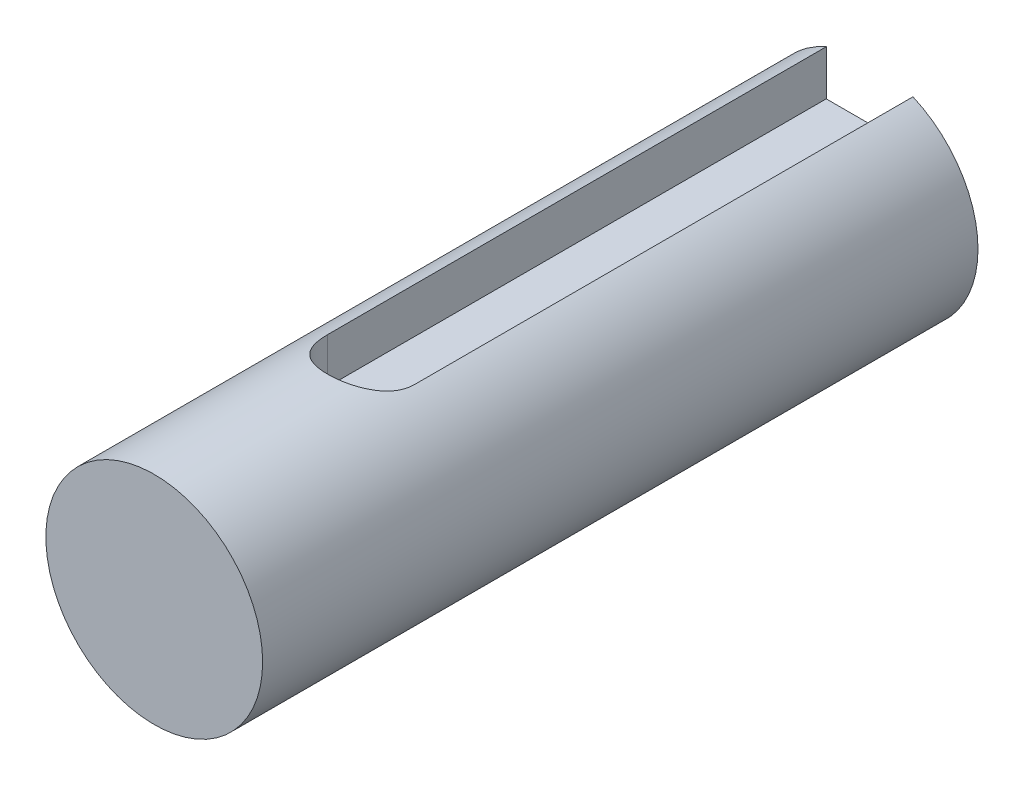
ISO-10303-21;
HEADER;
FILE_DESCRIPTION(('STEP AP214'),'2;1');
FILE_NAME('part.step','',(''),(''),'','','');
FILE_SCHEMA(('AUTOMOTIVE_DESIGN { 1 0 10303 214 1 1 1 1 }'));
ENDSEC;
DATA;
#1=APPLICATION_CONTEXT('core data for automotive mechanical design processes');
#2=APPLICATION_PROTOCOL_DEFINITION('international standard','automotive_design',2000,#1);
#3=PRODUCT_CONTEXT('',#1,'mechanical');
#4=PRODUCT('Part','Part','',(#3));
#5=PRODUCT_RELATED_PRODUCT_CATEGORY('part','',(#4));
#6=PRODUCT_DEFINITION_FORMATION('','',#4);
#7=PRODUCT_DEFINITION_CONTEXT('part definition',#1,'design');
#8=PRODUCT_DEFINITION('design','',#6,#7);
#9=PRODUCT_DEFINITION_SHAPE('','',#8);
#10=(LENGTH_UNIT() NAMED_UNIT(*) SI_UNIT(.MILLI.,.METRE.));
#11=(NAMED_UNIT(*) PLANE_ANGLE_UNIT() SI_UNIT($,.RADIAN.));
#12=(NAMED_UNIT(*) SI_UNIT($,.STERADIAN.) SOLID_ANGLE_UNIT());
#13=UNCERTAINTY_MEASURE_WITH_UNIT(LENGTH_MEASURE(1.E-05),#10,'distance_accuracy_value','');
#14=(GEOMETRIC_REPRESENTATION_CONTEXT(3) GLOBAL_UNCERTAINTY_ASSIGNED_CONTEXT((#13)) GLOBAL_UNIT_ASSIGNED_CONTEXT((#10,
#11,#12)) REPRESENTATION_CONTEXT('',''));
#15=CARTESIAN_POINT('',(0.,0.,0.));
#16=DIRECTION('',(0.,0.,1.));
#17=DIRECTION('',(1.,0.,0.));
#18=AXIS2_PLACEMENT_3D('',#15,#16,#17);
#19=CARTESIAN_POINT('',(30.,40.,-70.));
#20=DIRECTION('',(0.,0.,1.));
#21=DIRECTION('',(1.,0.,0.));
#22=AXIS2_PLACEMENT_3D('',#19,#20,#21);
#23=CYLINDRICAL_SURFACE('',#22,5.);
#24=DIRECTION('',(0.,0.,1.));
#25=VECTOR('',#24,1.);
#26=CARTESIAN_POINT('',(32.,44.5825756949558,-70.));
#27=LINE('',#26,#25);
#28=CARTESIAN_POINT('',(32.,44.5825756949558,-47.));
#29=VERTEX_POINT('',#28);
#30=CARTESIAN_POINT('',(32.,44.5825756949558,-70.));
#31=VERTEX_POINT('',#30);
#32=EDGE_CURVE('E112',#29,#31,#27,.F.);
#33=ORIENTED_EDGE('',*,*,#32,.F.);
#34=CARTESIAN_POINT('',(28.,44.5825756949558,-47.));
#35=CARTESIAN_POINT('',(27.9999920196365,44.5825646447038,-46.9461941474974));
#36=CARTESIAN_POINT('',(28.0021710863397,44.5835230607732,-46.8923943344423));
#37=CARTESIAN_POINT('',(28.0108409402655,44.5872962541754,-46.7852287017453));
#38=CARTESIAN_POINT('',(28.0173300853121,44.5901103244855,-46.731862724644));
#39=CARTESIAN_POINT('',(28.0345239632363,44.5974978292064,-46.6261531784412));
#40=CARTESIAN_POINT('',(28.0452120317957,44.6020643071753,-46.573806415956));
#41=CARTESIAN_POINT('',(28.0706836980934,44.6128005329668,-46.4702992282855));
#42=CARTESIAN_POINT('',(28.0854675458291,44.618970378654,-46.4191388757228));
#43=CARTESIAN_POINT('',(28.1357302820648,44.6395929124842,-46.268064149418));
#44=CARTESIAN_POINT('',(28.1771551053999,44.6561744915743,-46.1703457693103));
#45=CARTESIAN_POINT('',(28.2745180840782,44.6931237076538,-45.9832044199174));
#46=CARTESIAN_POINT('',(28.3304700366307,44.7134949386401,-45.8937894470383));
#47=CARTESIAN_POINT('',(28.4586816426314,44.7570099940211,-45.7207376033258));
#48=CARTESIAN_POINT('',(28.5316308600727,44.7802424563552,-45.6376327830798));
#49=CARTESIAN_POINT('',(28.6903035382379,44.8261279054865,-45.4844597277893));
#50=CARTESIAN_POINT('',(28.7760296150032,44.8487807724972,-45.4143941691343));
#51=CARTESIAN_POINT('',(28.9619940919103,44.8920341710608,-45.2865936058043));
#52=CARTESIAN_POINT('',(29.062672066949,44.9125182454353,-45.2294551907381));
#53=CARTESIAN_POINT('',(29.2731758567533,44.94803944125,-45.1331559273114));
#54=CARTESIAN_POINT('',(29.3829978309737,44.9630788354418,-45.0939875759483));
#55=CARTESIAN_POINT('',(29.6030325587043,44.9853831465381,-45.0366587986894));
#56=CARTESIAN_POINT('',(29.7129689454769,44.9929892254793,-45.0175730490943));
#57=CARTESIAN_POINT('',(29.9347315695435,45.0008031020108,-44.9979715200544));
#58=CARTESIAN_POINT('',(30.0465571232842,45.0010135205303,-44.9974491619765));
#59=CARTESIAN_POINT('',(30.2622333762268,44.994219600453,-45.0144828391599));
#60=CARTESIAN_POINT('',(30.3661792025068,44.9876198558546,-45.031025046674));
#61=CARTESIAN_POINT('',(30.5696747865009,44.9684927044145,-45.0799934270535));
#62=CARTESIAN_POINT('',(30.6692242950728,44.9559649620993,-45.1124204988686));
#63=CARTESIAN_POINT('',(30.8628975390703,44.9259683059878,-45.1926362964245));
#64=CARTESIAN_POINT('',(30.9569168513664,44.9084277475585,-45.2406492408104));
#65=CARTESIAN_POINT('',(31.1358074691978,44.8701460200804,-45.3504645885951));
#66=CARTESIAN_POINT('',(31.220675549847,44.8494037289645,-45.4122718296906));
#67=CARTESIAN_POINT('',(31.3847633927363,44.8052178274614,-45.5526441802585));
#68=CARTESIAN_POINT('',(31.4632477030894,44.7816862717288,-45.63204247467));
#69=CARTESIAN_POINT('',(31.6060992609948,44.7356195058465,-45.8029800951477));
#70=CARTESIAN_POINT('',(31.67046007709,44.7130847533278,-45.8945249220942));
#71=CARTESIAN_POINT('',(31.784936579336,44.6709568885602,-46.0904702840212));
#72=CARTESIAN_POINT('',(31.8345893221762,44.6514670215058,-46.1951648366602));
#73=CARTESIAN_POINT('',(31.9152129835726,44.6188610505958,-46.4123615244295));
#74=CARTESIAN_POINT('',(31.9462169600221,44.6057336762874,-46.5248494473383));
#75=CARTESIAN_POINT('',(31.9781058182572,44.5920830352949,-46.698743634158));
#76=CARTESIAN_POINT('',(31.9863050516598,44.5885343768053,-46.7586575493013));
#77=CARTESIAN_POINT('',(31.9972528210381,44.5837754031439,-46.8790350189955));
#78=CARTESIAN_POINT('',(32.0000047156857,44.5825636471174,-46.9394982117578));
#79=CARTESIAN_POINT('',(32.,44.5825756949558,-47.));
#80=B_SPLINE_CURVE_WITH_KNOTS('',3,(#34,#35,#36,#37,#38,#39,#40,#41,#42,#43,#44,#45,#46,#47,#48,
#49,#50,#51,#52,#53,#54,#55,#56,#57,#58,#59,#60,#61,#62,#63,#64,#65,#66,#67,#68,#69,#70,#71,#72,
#73,#74,#75,#76,#77,#78,#79),.UNSPECIFIED.,.F.,.F.,(4,2,2,2,2,2,2,2,2,2,2,2,2,2,2,2,2,2,2,2,2,2,
4),(0.,0.161354853098825,0.322648263883208,0.483307911251877,0.643977367092303,
0.964683001739087,1.28569434942625,1.62318047995497,1.9607358053919,2.31162858925763,
2.66237473197321,2.99613876504269,3.32978451514655,3.64468915259534,3.95961161305653,
4.27928176927546,4.59906421133018,4.93981874675153,5.28072813203932,5.63144241548461,
5.98153315592125,6.16300192557814,6.34435877193561),.UNSPECIFIED.);
#81=CARTESIAN_POINT('',(28.,44.5825756949558,-47.));
#82=VERTEX_POINT('',#81);
#83=EDGE_CURVE('E11',#82,#29,#80,.T.);
#84=ORIENTED_EDGE('',*,*,#83,.F.);
#85=DIRECTION('',(0.,0.,1.));
#86=VECTOR('',#85,1.);
#87=CARTESIAN_POINT('',(28.,44.5825756949558,-70.));
#88=LINE('',#87,#86);
#89=CARTESIAN_POINT('',(28.,44.5825756949558,-70.));
#90=VERTEX_POINT('',#89);
#91=EDGE_CURVE('E91',#90,#82,#88,.T.);
#92=ORIENTED_EDGE('',*,*,#91,.F.);
#93=CARTESIAN_POINT('',(30.,40.,-70.));
#94=DIRECTION('',(0.,0.,-1.));
#95=DIRECTION('',(-1.,0.,0.));
#96=AXIS2_PLACEMENT_3D('',#93,#94,#95);
#97=CIRCLE('',#96,5.);
#98=EDGE_CURVE('E114',#31,#90,#97,.T.);
#99=ORIENTED_EDGE('',*,*,#98,.F.);
#100=EDGE_LOOP('',(#33,#84,#92,#99));
#101=FACE_BOUND('',#100,.T.);
#102=CARTESIAN_POINT('',(30.,40.,-37.));
#103=DIRECTION('',(0.,0.,1.));
#104=DIRECTION('',(1.,0.,0.));
#105=AXIS2_PLACEMENT_3D('',#102,#103,#104);
#106=CIRCLE('',#105,5.);
#107=CARTESIAN_POINT('',(35.,40.,-37.));
#108=VERTEX_POINT('',#107);
#109=EDGE_CURVE('E103',#108,#108,#106,.T.);
#110=ORIENTED_EDGE('',*,*,#109,.F.);
#111=EDGE_LOOP('',(#110));
#112=FACE_BOUND('',#111,.T.);
#113=ADVANCED_FACE('F42',(#101,#112),#23,.T.);
#114=CARTESIAN_POINT('',(30.,40.,-70.));
#115=DIRECTION('',(0.,0.,-1.));
#116=DIRECTION('',(-1.,0.,0.));
#117=AXIS2_PLACEMENT_3D('',#114,#115,#116);
#118=PLANE('',#117);
#119=DIRECTION('',(-1.,0.,0.));
#120=VECTOR('',#119,1.);
#121=CARTESIAN_POINT('',(28.,42.5,-70.));
#122=LINE('',#121,#120);
#123=CARTESIAN_POINT('',(32.,42.5,-70.));
#124=VERTEX_POINT('',#123);
#125=CARTESIAN_POINT('',(28.,42.5,-70.));
#126=VERTEX_POINT('',#125);
#127=EDGE_CURVE('E97',#124,#126,#122,.T.);
#128=ORIENTED_EDGE('',*,*,#127,.F.);
#129=DIRECTION('',(0.,1.,0.));
#130=VECTOR('',#129,1.);
#131=CARTESIAN_POINT('',(32.,40.,-70.));
#132=LINE('',#131,#130);
#133=EDGE_CURVE('E55',#124,#31,#132,.T.);
#134=ORIENTED_EDGE('',*,*,#133,.T.);
#135=ORIENTED_EDGE('',*,*,#98,.T.);
#136=DIRECTION('',(0.,-1.,0.));
#137=VECTOR('',#136,1.);
#138=CARTESIAN_POINT('',(28.,40.,-70.));
#139=LINE('',#138,#137);
#140=EDGE_CURVE('E117',#90,#126,#139,.T.);
#141=ORIENTED_EDGE('',*,*,#140,.T.);
#142=EDGE_LOOP('',(#128,#134,#135,#141));
#143=FACE_BOUND('',#142,.T.);
#144=ADVANCED_FACE('F121',(#143),#118,.T.);
#145=CARTESIAN_POINT('',(30.,70.5,-47.));
#146=DIRECTION('',(0.,-1.,0.));
#147=DIRECTION('',(0.,0.,-1.));
#148=AXIS2_PLACEMENT_3D('',#145,#146,#147);
#149=CYLINDRICAL_SURFACE('',#148,2.);
#150=ORIENTED_EDGE('',*,*,#83,.T.);
#151=DIRECTION('',(0.,-1.,0.));
#152=VECTOR('',#151,1.);
#153=CARTESIAN_POINT('',(32.,70.5,-47.));
#154=LINE('',#153,#152);
#155=CARTESIAN_POINT('',(32.,42.5,-47.));
#156=VERTEX_POINT('',#155);
#157=EDGE_CURVE('E86',#29,#156,#154,.T.);
#158=ORIENTED_EDGE('',*,*,#157,.T.);
#159=CARTESIAN_POINT('',(30.,42.5,-47.));
#160=DIRECTION('',(0.,1.,0.));
#161=DIRECTION('',(0.,0.,1.));
#162=AXIS2_PLACEMENT_3D('',#159,#160,#161);
#163=CIRCLE('',#162,2.);
#164=CARTESIAN_POINT('',(28.,42.5,-47.));
#165=VERTEX_POINT('',#164);
#166=EDGE_CURVE('E88',#165,#156,#163,.T.);
#167=ORIENTED_EDGE('',*,*,#166,.F.);
#168=DIRECTION('',(0.,-1.,0.));
#169=VECTOR('',#168,1.);
#170=CARTESIAN_POINT('',(28.,70.5,-47.));
#171=LINE('',#170,#169);
#172=EDGE_CURVE('E92',#82,#165,#171,.T.);
#173=ORIENTED_EDGE('',*,*,#172,.F.);
#174=EDGE_LOOP('',(#150,#158,#167,#173));
#175=FACE_BOUND('',#174,.T.);
#176=ADVANCED_FACE('F87',(#175),#149,.F.);
#177=CARTESIAN_POINT('',(32.,70.5,-70.));
#178=DIRECTION('',(-1.,0.,0.));
#179=DIRECTION('',(0.,0.,1.));
#180=AXIS2_PLACEMENT_3D('',#177,#178,#179);
#181=PLANE('',#180);
#182=ORIENTED_EDGE('',*,*,#32,.T.);
#183=ORIENTED_EDGE('',*,*,#133,.F.);
#184=DIRECTION('',(0.,0.,-1.));
#185=VECTOR('',#184,1.);
#186=CARTESIAN_POINT('',(32.,42.5,-70.));
#187=LINE('',#186,#185);
#188=EDGE_CURVE('E62',#156,#124,#187,.T.);
#189=ORIENTED_EDGE('',*,*,#188,.F.);
#190=ORIENTED_EDGE('',*,*,#157,.F.);
#191=EDGE_LOOP('',(#182,#183,#189,#190));
#192=FACE_BOUND('',#191,.T.);
#193=ADVANCED_FACE('F94',(#192),#181,.T.);
#194=CARTESIAN_POINT('',(28.,70.5,-47.));
#195=DIRECTION('',(1.,0.,0.));
#196=DIRECTION('',(0.,0.,-1.));
#197=AXIS2_PLACEMENT_3D('',#194,#195,#196);
#198=PLANE('',#197);
#199=ORIENTED_EDGE('',*,*,#91,.T.);
#200=ORIENTED_EDGE('',*,*,#172,.T.);
#201=DIRECTION('',(0.,0.,1.));
#202=VECTOR('',#201,1.);
#203=CARTESIAN_POINT('',(28.,42.5,-47.));
#204=LINE('',#203,#202);
#205=EDGE_CURVE('E102',#126,#165,#204,.T.);
#206=ORIENTED_EDGE('',*,*,#205,.F.);
#207=ORIENTED_EDGE('',*,*,#140,.F.);
#208=EDGE_LOOP('',(#199,#200,#206,#207));
#209=FACE_BOUND('',#208,.T.);
#210=ADVANCED_FACE('F126',(#209),#198,.T.);
#211=CARTESIAN_POINT('',(30.,42.5,-47.));
#212=DIRECTION('',(0.,1.,0.));
#213=DIRECTION('',(0.,0.,1.));
#214=AXIS2_PLACEMENT_3D('',#211,#212,#213);
#215=PLANE('',#214);
#216=ORIENTED_EDGE('',*,*,#166,.T.);
#217=ORIENTED_EDGE('',*,*,#188,.T.);
#218=ORIENTED_EDGE('',*,*,#127,.T.);
#219=ORIENTED_EDGE('',*,*,#205,.T.);
#220=EDGE_LOOP('',(#216,#217,#218,#219));
#221=FACE_BOUND('',#220,.T.);
#222=ADVANCED_FACE('F100',(#221),#215,.T.);
#223=CARTESIAN_POINT('',(30.,40.,-37.));
#224=DIRECTION('',(0.,0.,1.));
#225=DIRECTION('',(1.,0.,0.));
#226=AXIS2_PLACEMENT_3D('',#223,#224,#225);
#227=PLANE('',#226);
#228=ORIENTED_EDGE('',*,*,#109,.T.);
#229=EDGE_LOOP('',(#228));
#230=FACE_BOUND('',#229,.T.);
#231=ADVANCED_FACE('F133',(#230),#227,.T.);
#232=CLOSED_SHELL('',(#113,#144,#176,#193,#210,#222,#231));
#233=MANIFOLD_SOLID_BREP('B2',#232);
#234=ADVANCED_BREP_SHAPE_REPRESENTATION('',(#18,#233),#14);
#235=SHAPE_DEFINITION_REPRESENTATION(#9,#234);
ENDSEC;
END-ISO-10303-21;
